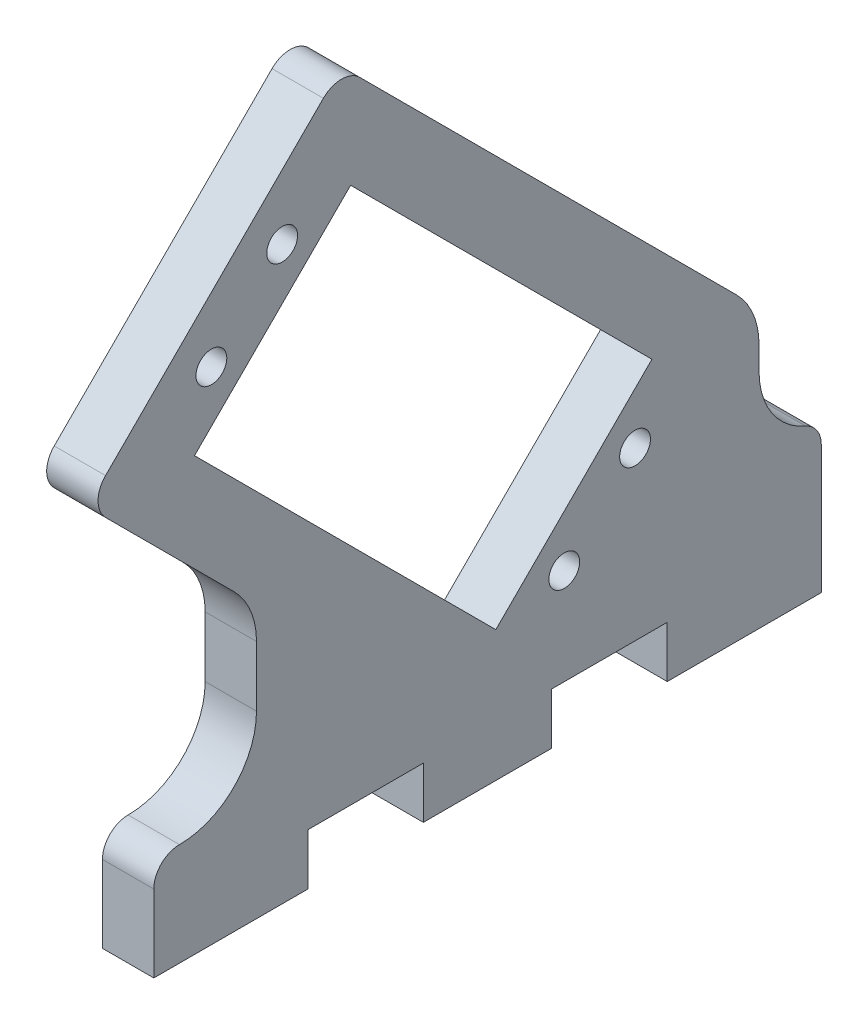
ISO-10303-21;
HEADER;
FILE_DESCRIPTION(('STEP AP214'),'2;1');
FILE_NAME('part.step','',(''),(''),'','','');
FILE_SCHEMA(('AUTOMOTIVE_DESIGN { 1 0 10303 214 1 1 1 1 }'));
ENDSEC;
DATA;
#1=APPLICATION_CONTEXT('core data for automotive mechanical design processes');
#2=APPLICATION_PROTOCOL_DEFINITION('international standard','automotive_design',2000,#1);
#3=PRODUCT_CONTEXT('',#1,'mechanical');
#4=PRODUCT('Part','Part','',(#3));
#5=PRODUCT_RELATED_PRODUCT_CATEGORY('part','',(#4));
#6=PRODUCT_DEFINITION_FORMATION('','',#4);
#7=PRODUCT_DEFINITION_CONTEXT('part definition',#1,'design');
#8=PRODUCT_DEFINITION('design','',#6,#7);
#9=PRODUCT_DEFINITION_SHAPE('','',#8);
#10=(LENGTH_UNIT() NAMED_UNIT(*) SI_UNIT(.MILLI.,.METRE.));
#11=(NAMED_UNIT(*) PLANE_ANGLE_UNIT() SI_UNIT($,.RADIAN.));
#12=(NAMED_UNIT(*) SI_UNIT($,.STERADIAN.) SOLID_ANGLE_UNIT());
#13=UNCERTAINTY_MEASURE_WITH_UNIT(LENGTH_MEASURE(1.E-05),#10,'distance_accuracy_value','');
#14=(GEOMETRIC_REPRESENTATION_CONTEXT(3) GLOBAL_UNCERTAINTY_ASSIGNED_CONTEXT((#13)) GLOBAL_UNIT_ASSIGNED_CONTEXT((#10,
#11,#12)) REPRESENTATION_CONTEXT('',''));
#15=CARTESIAN_POINT('',(0.,0.,0.));
#16=DIRECTION('',(0.,0.,1.));
#17=DIRECTION('',(1.,0.,0.));
#18=AXIS2_PLACEMENT_3D('',#15,#16,#17);
#19=CARTESIAN_POINT('',(0.,0.,0.));
#20=DIRECTION('',(1.,0.,0.));
#21=DIRECTION('',(0.,0.,-1.));
#22=AXIS2_PLACEMENT_3D('',#19,#20,#21);
#23=PLANE('',#22);
#24=CARTESIAN_POINT('',(0.,21.2644507754515,-46.866522151183));
#25=DIRECTION('',(-1.,0.,0.));
#26=DIRECTION('',(0.,0.,1.));
#27=AXIS2_PLACEMENT_3D('',#24,#25,#26);
#28=CIRCLE('',#27,1.5);
#29=CARTESIAN_POINT('',(0.,21.2644507754515,-45.366522151183));
#30=VERTEX_POINT('',#29);
#31=EDGE_CURVE('E243',#30,#30,#28,.F.);
#32=ORIENTED_EDGE('',*,*,#31,.T.);
#33=EDGE_LOOP('',(#32));
#34=FACE_BOUND('',#33,.T.);
#35=CARTESIAN_POINT('',(0.,48.7355492245485,-5.60684146894777));
#36=DIRECTION('',(-1.,0.,0.));
#37=DIRECTION('',(0.,0.,1.));
#38=AXIS2_PLACEMENT_3D('',#35,#36,#37);
#39=CIRCLE('',#38,1.50000000000024);
#40=CARTESIAN_POINT('',(0.,48.7355492245485,-4.10684146894753));
#41=VERTEX_POINT('',#40);
#42=EDGE_CURVE('E485',#41,#41,#39,.F.);
#43=ORIENTED_EDGE('',*,*,#42,.T.);
#44=EDGE_LOOP('',(#43));
#45=FACE_BOUND('',#44,.T.);
#46=CARTESIAN_POINT('',(0.,55.6298403411174,-12.5011325855165));
#47=DIRECTION('',(-1.,0.,0.));
#48=DIRECTION('',(0.,0.,1.));
#49=AXIS2_PLACEMENT_3D('',#46,#47,#48);
#50=CIRCLE('',#49,1.49999999999996);
#51=CARTESIAN_POINT('',(0.,55.6298403411174,-11.0011325855166));
#52=VERTEX_POINT('',#51);
#53=EDGE_CURVE('E248',#52,#52,#50,.F.);
#54=ORIENTED_EDGE('',*,*,#53,.T.);
#55=EDGE_LOOP('',(#54));
#56=FACE_BOUND('',#55,.T.);
#57=CARTESIAN_POINT('',(0.,23.9384469938531,-51.4403704399434));
#58=DIRECTION('',(-1.,0.,0.));
#59=DIRECTION('',(0.,0.,1.));
#60=AXIS2_PLACEMENT_3D('',#57,#58,#59);
#61=CIRCLE('',#60,7.5);
#62=CARTESIAN_POINT('',(0.,23.938446993853,-58.9403704399434));
#63=VERTEX_POINT('',#62);
#64=CARTESIAN_POINT('',(0.,29.2417478527523,-56.7436712988425));
#65=VERTEX_POINT('',#64);
#66=EDGE_CURVE('E390',#63,#65,#61,.F.);
#67=ORIENTED_EDGE('',*,*,#66,.F.);
#68=DIRECTION('',(0.,-1.,0.));
#69=VECTOR('',#68,1.);
#70=CARTESIAN_POINT('',(0.,15.,-58.9403704399433));
#71=LINE('',#70,#69);
#72=CARTESIAN_POINT('',(0.,21.6909455876978,-58.9403704399434));
#73=VERTEX_POINT('',#72);
#74=EDGE_CURVE('E119',#63,#73,#71,.T.);
#75=ORIENTED_EDGE('',*,*,#74,.T.);
#76=CARTESIAN_POINT('',(0.,21.6909455876977,-66.4403704399434));
#77=DIRECTION('',(-1.,0.,0.));
#78=DIRECTION('',(0.,0.,1.));
#79=AXIS2_PLACEMENT_3D('',#76,#77,#78);
#80=CIRCLE('',#79,7.5);
#81=CARTESIAN_POINT('',(0.,14.7977363969244,-63.4850926099858));
#82=VERTEX_POINT('',#81);
#83=EDGE_CURVE('E249',#73,#82,#80,.F.);
#84=ORIENTED_EDGE('',*,*,#83,.T.);
#85=CARTESIAN_POINT('',(0.,12.5,-62.5));
#86=DIRECTION('',(-1.,0.,0.));
#87=DIRECTION('',(0.,0.,1.));
#88=AXIS2_PLACEMENT_3D('',#85,#86,#87);
#89=CIRCLE('',#88,2.5);
#90=CARTESIAN_POINT('',(0.,12.5,-65.));
#91=VERTEX_POINT('',#90);
#92=EDGE_CURVE('E255',#91,#82,#89,.F.);
#93=ORIENTED_EDGE('',*,*,#92,.F.);
#94=DIRECTION('',(0.,-1.,0.));
#95=VECTOR('',#94,1.);
#96=CARTESIAN_POINT('',(0.,0.,-65.));
#97=LINE('',#96,#95);
#98=CARTESIAN_POINT('',(0.,0.,-65.));
#99=VERTEX_POINT('',#98);
#100=EDGE_CURVE('E258',#91,#99,#97,.T.);
#101=ORIENTED_EDGE('',*,*,#100,.T.);
#102=DIRECTION('',(0.,0.,1.));
#103=VECTOR('',#102,1.);
#104=CARTESIAN_POINT('',(0.,0.,-50.));
#105=LINE('',#104,#103);
#106=CARTESIAN_POINT('',(0.,0.,-50.));
#107=VERTEX_POINT('',#106);
#108=EDGE_CURVE('E259',#99,#107,#105,.T.);
#109=ORIENTED_EDGE('',*,*,#108,.T.);
#110=DIRECTION('',(0.,1.,0.));
#111=VECTOR('',#110,1.);
#112=CARTESIAN_POINT('',(0.,5.,-50.));
#113=LINE('',#112,#111);
#114=CARTESIAN_POINT('',(0.,5.,-50.));
#115=VERTEX_POINT('',#114);
#116=EDGE_CURVE('E271',#107,#115,#113,.T.);
#117=ORIENTED_EDGE('',*,*,#116,.T.);
#118=DIRECTION('',(0.,0.,1.));
#119=VECTOR('',#118,1.);
#120=CARTESIAN_POINT('',(0.,5.,-38.75));
#121=LINE('',#120,#119);
#122=CARTESIAN_POINT('',(0.,5.,-38.75));
#123=VERTEX_POINT('',#122);
#124=EDGE_CURVE('E281',#115,#123,#121,.T.);
#125=ORIENTED_EDGE('',*,*,#124,.T.);
#126=DIRECTION('',(0.,1.,0.));
#127=VECTOR('',#126,1.);
#128=CARTESIAN_POINT('',(0.,0.,-38.75));
#129=LINE('',#128,#127);
#130=CARTESIAN_POINT('',(0.,0.,-38.75));
#131=VERTEX_POINT('',#130);
#132=EDGE_CURVE('E291',#123,#131,#129,.F.);
#133=ORIENTED_EDGE('',*,*,#132,.T.);
#134=DIRECTION('',(0.,0.,1.));
#135=VECTOR('',#134,1.);
#136=CARTESIAN_POINT('',(0.,0.,-26.25));
#137=LINE('',#136,#135);
#138=CARTESIAN_POINT('',(0.,0.,-26.25));
#139=VERTEX_POINT('',#138);
#140=EDGE_CURVE('E301',#131,#139,#137,.T.);
#141=ORIENTED_EDGE('',*,*,#140,.T.);
#142=DIRECTION('',(0.,1.,0.));
#143=VECTOR('',#142,1.);
#144=CARTESIAN_POINT('',(0.,5.,-26.25));
#145=LINE('',#144,#143);
#146=CARTESIAN_POINT('',(0.,5.,-26.25));
#147=VERTEX_POINT('',#146);
#148=EDGE_CURVE('E311',#139,#147,#145,.T.);
#149=ORIENTED_EDGE('',*,*,#148,.T.);
#150=DIRECTION('',(0.,0.,1.));
#151=VECTOR('',#150,1.);
#152=CARTESIAN_POINT('',(0.,5.,-15.));
#153=LINE('',#152,#151);
#154=CARTESIAN_POINT('',(0.,5.,-15.));
#155=VERTEX_POINT('',#154);
#156=EDGE_CURVE('E321',#147,#155,#153,.T.);
#157=ORIENTED_EDGE('',*,*,#156,.T.);
#158=DIRECTION('',(0.,1.,0.));
#159=VECTOR('',#158,1.);
#160=CARTESIAN_POINT('',(0.,0.,-15.));
#161=LINE('',#160,#159);
#162=CARTESIAN_POINT('',(0.,0.,-15.));
#163=VERTEX_POINT('',#162);
#164=EDGE_CURVE('E331',#155,#163,#161,.F.);
#165=ORIENTED_EDGE('',*,*,#164,.T.);
#166=DIRECTION('',(0.,0.,1.));
#167=VECTOR('',#166,1.);
#168=CARTESIAN_POINT('',(0.,0.,0.));
#169=LINE('',#168,#167);
#170=CARTESIAN_POINT('',(0.,0.,0.));
#171=VERTEX_POINT('',#170);
#172=EDGE_CURVE('E341',#163,#171,#169,.T.);
#173=ORIENTED_EDGE('',*,*,#172,.T.);
#174=DIRECTION('',(0.,1.,0.));
#175=VECTOR('',#174,1.);
#176=CARTESIAN_POINT('',(0.,10.,0.));
#177=LINE('',#176,#175);
#178=CARTESIAN_POINT('',(0.,7.5,0.));
#179=VERTEX_POINT('',#178);
#180=EDGE_CURVE('E355',#171,#179,#177,.T.);
#181=ORIENTED_EDGE('',*,*,#180,.T.);
#182=CARTESIAN_POINT('',(0.,7.5,-2.5));
#183=DIRECTION('',(-1.,0.,0.));
#184=DIRECTION('',(0.,0.,1.));
#185=AXIS2_PLACEMENT_3D('',#182,#183,#184);
#186=CIRCLE('',#185,2.5);
#187=CARTESIAN_POINT('',(0.,10.,-2.5));
#188=VERTEX_POINT('',#187);
#189=EDGE_CURVE('E359',#188,#179,#186,.F.);
#190=ORIENTED_EDGE('',*,*,#189,.F.);
#191=CARTESIAN_POINT('',(0.,17.5,-2.5));
#192=DIRECTION('',(1.,0.,0.));
#193=DIRECTION('',(0.,0.,-1.));
#194=AXIS2_PLACEMENT_3D('',#191,#192,#193);
#195=CIRCLE('',#194,7.5);
#196=CARTESIAN_POINT('',(0.,17.5,-10.));
#197=VERTEX_POINT('',#196);
#198=EDGE_CURVE('E362',#188,#197,#195,.T.);
#199=ORIENTED_EDGE('',*,*,#198,.T.);
#200=DIRECTION('',(0.,1.,0.));
#201=VECTOR('',#200,1.);
#202=CARTESIAN_POINT('',(0.,26.4879444685361,-10.));
#203=LINE('',#202,#201);
#204=CARTESIAN_POINT('',(0.,23.3813427507378,-10.));
#205=VERTEX_POINT('',#204);
#206=EDGE_CURVE('E365',#197,#205,#203,.T.);
#207=ORIENTED_EDGE('',*,*,#206,.T.);
#208=CARTESIAN_POINT('',(0.,23.3813427507378,-2.5));
#209=DIRECTION('',(1.,0.,0.));
#210=DIRECTION('',(0.,0.,-1.));
#211=AXIS2_PLACEMENT_3D('',#208,#209,#210);
#212=CIRCLE('',#211,7.5);
#213=CARTESIAN_POINT('',(0.,28.684643609637,-7.80330085889907));
#214=VERTEX_POINT('',#213);
#215=EDGE_CURVE('E368',#205,#214,#212,.T.);
#216=ORIENTED_EDGE('',*,*,#215,.T.);
#217=DIRECTION('',(0.,0.707106781186542,0.707106781186553));
#218=VECTOR('',#217,1.);
#219=CARTESIAN_POINT('',(0.,42.9549512883482,6.46700681981233));
#220=LINE('',#219,#218);
#221=CARTESIAN_POINT('',(0.,41.1871843353818,4.69923986684595));
#222=VERTEX_POINT('',#221);
#223=EDGE_CURVE('E372',#214,#222,#220,.T.);
#224=ORIENTED_EDGE('',*,*,#223,.T.);
#225=CARTESIAN_POINT('',(0.,42.9549512883482,2.9314729138796));
#226=DIRECTION('',(-1.,0.,0.));
#227=DIRECTION('',(0.,0.,1.));
#228=AXIS2_PLACEMENT_3D('',#225,#226,#227);
#229=CIRCLE('',#228,2.5);
#230=CARTESIAN_POINT('',(0.,44.7227182413145,4.69923986684598));
#231=VERTEX_POINT('',#230);
#232=EDGE_CURVE('E373',#231,#222,#229,.F.);
#233=ORIENTED_EDGE('',*,*,#232,.F.);
#234=DIRECTION('',(0.,0.707106781186553,-0.707106781186542));
#235=VECTOR('',#234,1.);
#236=CARTESIAN_POINT('',(0.,42.9549512883482,6.46700681981233));
#237=LINE('',#236,#235);
#238=CARTESIAN_POINT('',(0.,65.9359216769111,-16.5139635687503));
#239=VERTEX_POINT('',#238);
#240=EDGE_CURVE('E379',#231,#239,#237,.T.);
#241=ORIENTED_EDGE('',*,*,#240,.T.);
#242=CARTESIAN_POINT('',(0.,64.1681547239448,-18.2817305217167));
#243=DIRECTION('',(-1.,0.,0.));
#244=DIRECTION('',(0.,0.,1.));
#245=AXIS2_PLACEMENT_3D('',#242,#243,#244);
#246=CIRCLE('',#245,2.5);
#247=CARTESIAN_POINT('',(0.,65.9359216769112,-20.049497474683));
#248=VERTEX_POINT('',#247);
#249=EDGE_CURVE('E383',#248,#239,#246,.F.);
#250=ORIENTED_EDGE('',*,*,#249,.F.);
#251=DIRECTION('',(0.,-0.707106781186542,-0.707106781186553));
#252=VECTOR('',#251,1.);
#253=CARTESIAN_POINT('',(0.,67.7036886298775,-18.2817305217166));
#254=LINE('',#253,#252);
#255=EDGE_CURVE('E386',#248,#65,#254,.T.);
#256=ORIENTED_EDGE('',*,*,#255,.T.);
#257=EDGE_LOOP('',(#67,#75,#84,#93,#101,#109,#117,#125,#133,#141,#149,#157,#165,#173,#181,#190,
#199,#207,#216,#224,#233,#241,#250,#256));
#258=FACE_BOUND('',#257,.T.);
#259=DIRECTION('',(0.,0.707106781186542,0.707106781186553));
#260=VECTOR('',#259,1.);
#261=CARTESIAN_POINT('',(0.,42.0710678118647,-3.96281820269097));
#262=LINE('',#261,#260);
#263=CARTESIAN_POINT('',(0.,12.7261363926231,-33.3077496219329));
#264=VERTEX_POINT('',#263);
#265=CARTESIAN_POINT('',(0.,42.0710678118647,-3.96281820269097));
#266=VERTEX_POINT('',#265);
#267=EDGE_CURVE('E129',#264,#266,#262,.T.);
#268=ORIENTED_EDGE('',*,*,#267,.F.);
#269=DIRECTION('',(0.,-0.707106781186553,0.707106781186542));
#270=VECTOR('',#269,1.);
#271=CARTESIAN_POINT('',(0.,12.7261363926231,-33.3077496219329));
#272=LINE('',#271,#270);
#273=CARTESIAN_POINT('',(0.,27.928932188134,-48.5105454174436));
#274=VERTEX_POINT('',#273);
#275=EDGE_CURVE('E394',#274,#264,#272,.T.);
#276=ORIENTED_EDGE('',*,*,#275,.F.);
#277=DIRECTION('',(0.,-0.707106781186542,-0.707106781186553));
#278=VECTOR('',#277,1.);
#279=CARTESIAN_POINT('',(0.,57.2738636073755,-19.1656139982016));
#280=LINE('',#279,#278);
#281=CARTESIAN_POINT('',(0.,57.2738636073755,-19.1656139982016));
#282=VERTEX_POINT('',#281);
#283=EDGE_CURVE('E224',#282,#274,#280,.T.);
#284=ORIENTED_EDGE('',*,*,#283,.F.);
#285=DIRECTION('',(0.,0.707106781186553,-0.707106781186542));
#286=VECTOR('',#285,1.);
#287=CARTESIAN_POINT('',(0.,42.0710678118647,-3.96281820269097));
#288=LINE('',#287,#286);
#289=EDGE_CURVE('E225',#266,#282,#288,.T.);
#290=ORIENTED_EDGE('',*,*,#289,.F.);
#291=EDGE_LOOP('',(#268,#276,#284,#290));
#292=FACE_BOUND('',#291,.T.);
#293=CARTESIAN_POINT('',(0.,14.3701596588826,-39.9722310346143));
#294=DIRECTION('',(-1.,0.,0.));
#295=DIRECTION('',(0.,0.,1.));
#296=AXIS2_PLACEMENT_3D('',#293,#294,#295);
#297=CIRCLE('',#296,1.50000000000002);
#298=CARTESIAN_POINT('',(0.,14.3701596588826,-38.4722310346142));
#299=VERTEX_POINT('',#298);
#300=EDGE_CURVE('E19',#299,#299,#297,.F.);
#301=ORIENTED_EDGE('',*,*,#300,.T.);
#302=EDGE_LOOP('',(#301));
#303=FACE_BOUND('',#302,.T.);
#304=ADVANCED_FACE('F16',(#34,#45,#56,#258,#292,#303),#23,.F.);
#305=CARTESIAN_POINT('',(5.,14.3701596588826,-39.9722310346143));
#306=DIRECTION('',(-1.,0.,0.));
#307=DIRECTION('',(0.,0.,1.));
#308=AXIS2_PLACEMENT_3D('',#305,#306,#307);
#309=CYLINDRICAL_SURFACE('',#308,1.50000000000002);
#310=CARTESIAN_POINT('',(5.,14.3701596588826,-39.9722310346143));
#311=DIRECTION('',(-1.,0.,0.));
#312=DIRECTION('',(0.,0.,1.));
#313=AXIS2_PLACEMENT_3D('',#310,#311,#312);
#314=CIRCLE('',#313,1.50000000000002);
#315=CARTESIAN_POINT('',(5.,14.3701596588826,-38.4722310346142));
#316=VERTEX_POINT('',#315);
#317=EDGE_CURVE('E240',#316,#316,#314,.T.);
#318=ORIENTED_EDGE('',*,*,#317,.F.);
#319=EDGE_LOOP('',(#318));
#320=FACE_BOUND('',#319,.T.);
#321=ORIENTED_EDGE('',*,*,#300,.F.);
#322=EDGE_LOOP('',(#321));
#323=FACE_BOUND('',#322,.T.);
#324=ADVANCED_FACE('F520',(#320,#323),#309,.F.);
#325=CARTESIAN_POINT('',(5.,42.0710678118647,-3.96281820269097));
#326=DIRECTION('',(0.,0.707106781186553,-0.707106781186542));
#327=DIRECTION('',(0.,0.707106781186542,0.707106781186553));
#328=AXIS2_PLACEMENT_3D('',#325,#326,#327);
#329=PLANE('',#328);
#330=DIRECTION('',(0.,0.707106781186542,0.707106781186553));
#331=VECTOR('',#330,1.);
#332=CARTESIAN_POINT('',(5.,12.7261363926231,-33.3077496219329));
#333=LINE('',#332,#331);
#334=CARTESIAN_POINT('',(5.,12.7261363926231,-33.3077496219329));
#335=VERTEX_POINT('',#334);
#336=CARTESIAN_POINT('',(5.,42.0710678118647,-3.96281820269097));
#337=VERTEX_POINT('',#336);
#338=EDGE_CURVE('E220',#335,#337,#333,.T.);
#339=ORIENTED_EDGE('',*,*,#338,.F.);
#340=DIRECTION('',(1.,0.,0.));
#341=VECTOR('',#340,1.);
#342=CARTESIAN_POINT('',(5.,12.7261363926231,-33.3077496219329));
#343=LINE('',#342,#341);
#344=EDGE_CURVE('E392',#264,#335,#343,.T.);
#345=ORIENTED_EDGE('',*,*,#344,.F.);
#346=ORIENTED_EDGE('',*,*,#267,.T.);
#347=DIRECTION('',(1.,0.,0.));
#348=VECTOR('',#347,1.);
#349=CARTESIAN_POINT('',(5.,42.0710678118647,-3.96281820269097));
#350=LINE('',#349,#348);
#351=EDGE_CURVE('E216',#337,#266,#350,.F.);
#352=ORIENTED_EDGE('',*,*,#351,.F.);
#353=EDGE_LOOP('',(#339,#345,#346,#352));
#354=FACE_BOUND('',#353,.T.);
#355=ADVANCED_FACE('F218',(#354),#329,.T.);
#356=CARTESIAN_POINT('',(5.,42.0710678118647,-3.96281820269097));
#357=DIRECTION('',(0.,-0.707106781186542,-0.707106781186553));
#358=DIRECTION('',(0.,0.707106781186553,-0.707106781186542));
#359=AXIS2_PLACEMENT_3D('',#356,#357,#358);
#360=PLANE('',#359);
#361=DIRECTION('',(0.,0.707106781186552,-0.707106781186542));
#362=VECTOR('',#361,1.);
#363=CARTESIAN_POINT('',(5.,42.0710678118647,-3.96281820269097));
#364=LINE('',#363,#362);
#365=CARTESIAN_POINT('',(5.,57.2738636073755,-19.1656139982016));
#366=VERTEX_POINT('',#365);
#367=EDGE_CURVE('E228',#337,#366,#364,.T.);
#368=ORIENTED_EDGE('',*,*,#367,.F.);
#369=ORIENTED_EDGE('',*,*,#351,.T.);
#370=ORIENTED_EDGE('',*,*,#289,.T.);
#371=DIRECTION('',(1.,0.,0.));
#372=VECTOR('',#371,1.);
#373=CARTESIAN_POINT('',(5.,57.2738636073755,-19.1656139982016));
#374=LINE('',#373,#372);
#375=EDGE_CURVE('E231',#366,#282,#374,.F.);
#376=ORIENTED_EDGE('',*,*,#375,.F.);
#377=EDGE_LOOP('',(#368,#369,#370,#376));
#378=FACE_BOUND('',#377,.T.);
#379=ADVANCED_FACE('F229',(#378),#360,.T.);
#380=CARTESIAN_POINT('',(5.,57.2738636073755,-19.1656139982016));
#381=DIRECTION('',(0.,-0.707106781186553,0.707106781186542));
#382=DIRECTION('',(0.,-0.707106781186542,-0.707106781186553));
#383=AXIS2_PLACEMENT_3D('',#380,#381,#382);
#384=PLANE('',#383);
#385=DIRECTION('',(0.,-0.707106781186542,-0.707106781186552));
#386=VECTOR('',#385,1.);
#387=CARTESIAN_POINT('',(5.,57.2738636073755,-19.1656139982016));
#388=LINE('',#387,#386);
#389=CARTESIAN_POINT('',(5.,27.928932188134,-48.5105454174436));
#390=VERTEX_POINT('',#389);
#391=EDGE_CURVE('E234',#366,#390,#388,.T.);
#392=ORIENTED_EDGE('',*,*,#391,.F.);
#393=ORIENTED_EDGE('',*,*,#375,.T.);
#394=ORIENTED_EDGE('',*,*,#283,.T.);
#395=DIRECTION('',(1.,0.,0.));
#396=VECTOR('',#395,1.);
#397=CARTESIAN_POINT('',(5.,27.928932188134,-48.5105454174436));
#398=LINE('',#397,#396);
#399=EDGE_CURVE('E206',#390,#274,#398,.F.);
#400=ORIENTED_EDGE('',*,*,#399,.F.);
#401=EDGE_LOOP('',(#392,#393,#394,#400));
#402=FACE_BOUND('',#401,.T.);
#403=ADVANCED_FACE('F515',(#402),#384,.T.);
#404=CARTESIAN_POINT('',(5.,12.7261363926231,-33.3077496219329));
#405=DIRECTION('',(0.,0.707106781186542,0.707106781186553));
#406=DIRECTION('',(0.,-0.707106781186553,0.707106781186542));
#407=AXIS2_PLACEMENT_3D('',#404,#405,#406);
#408=PLANE('',#407);
#409=DIRECTION('',(0.,-0.707106781186553,0.707106781186542));
#410=VECTOR('',#409,1.);
#411=CARTESIAN_POINT('',(5.,27.928932188134,-48.5105454174436));
#412=LINE('',#411,#410);
#413=EDGE_CURVE('E239',#390,#335,#412,.T.);
#414=ORIENTED_EDGE('',*,*,#413,.F.);
#415=ORIENTED_EDGE('',*,*,#399,.T.);
#416=ORIENTED_EDGE('',*,*,#275,.T.);
#417=ORIENTED_EDGE('',*,*,#344,.T.);
#418=EDGE_LOOP('',(#414,#415,#416,#417));
#419=FACE_BOUND('',#418,.T.);
#420=ADVANCED_FACE('F517',(#419),#408,.T.);
#421=CARTESIAN_POINT('',(5.,15.,-58.9403704399433));
#422=DIRECTION('',(0.,0.,1.));
#423=DIRECTION('',(0.,-1.,0.));
#424=AXIS2_PLACEMENT_3D('',#421,#422,#423);
#425=PLANE('',#424);
#426=DIRECTION('',(-1.,0.,0.));
#427=VECTOR('',#426,1.);
#428=CARTESIAN_POINT('',(5.,23.938446993853,-58.9403704399434));
#429=LINE('',#428,#427);
#430=CARTESIAN_POINT('',(5.,23.9384469938531,-58.9403704399434));
#431=VERTEX_POINT('',#430);
#432=EDGE_CURVE('E387',#431,#63,#429,.T.);
#433=ORIENTED_EDGE('',*,*,#432,.F.);
#434=DIRECTION('',(0.,1.,0.));
#435=VECTOR('',#434,1.);
#436=CARTESIAN_POINT('',(5.,0.,-58.9403704399433));
#437=LINE('',#436,#435);
#438=CARTESIAN_POINT('',(5.,21.6909455876977,-58.9403704399434));
#439=VERTEX_POINT('',#438);
#440=EDGE_CURVE('E197',#439,#431,#437,.T.);
#441=ORIENTED_EDGE('',*,*,#440,.F.);
#442=DIRECTION('',(-1.,0.,0.));
#443=VECTOR('',#442,1.);
#444=CARTESIAN_POINT('',(5.,21.6909455876977,-58.9403704399434));
#445=LINE('',#444,#443);
#446=EDGE_CURVE('E250',#439,#73,#445,.T.);
#447=ORIENTED_EDGE('',*,*,#446,.T.);
#448=ORIENTED_EDGE('',*,*,#74,.F.);
#449=EDGE_LOOP('',(#433,#441,#447,#448));
#450=FACE_BOUND('',#449,.T.);
#451=ADVANCED_FACE('F639',(#450),#425,.F.);
#452=CARTESIAN_POINT('',(5.,23.9384469938531,-51.4403704399434));
#453=DIRECTION('',(-1.,0.,0.));
#454=DIRECTION('',(0.,0.,1.));
#455=AXIS2_PLACEMENT_3D('',#452,#453,#454);
#456=CYLINDRICAL_SURFACE('',#455,7.5);
#457=ORIENTED_EDGE('',*,*,#66,.T.);
#458=DIRECTION('',(1.,0.,0.));
#459=VECTOR('',#458,1.);
#460=CARTESIAN_POINT('',(5.,29.2417478527522,-56.7436712988425));
#461=LINE('',#460,#459);
#462=CARTESIAN_POINT('',(5.,29.2417478527523,-56.7436712988425));
#463=VERTEX_POINT('',#462);
#464=EDGE_CURVE('E384',#65,#463,#461,.T.);
#465=ORIENTED_EDGE('',*,*,#464,.T.);
#466=CARTESIAN_POINT('',(5.,23.9384469938531,-51.4403704399434));
#467=DIRECTION('',(-1.,0.,0.));
#468=DIRECTION('',(0.,0.,1.));
#469=AXIS2_PLACEMENT_3D('',#466,#467,#468);
#470=CIRCLE('',#469,7.5);
#471=EDGE_CURVE('E480',#431,#463,#470,.F.);
#472=ORIENTED_EDGE('',*,*,#471,.F.);
#473=ORIENTED_EDGE('',*,*,#432,.T.);
#474=EDGE_LOOP('',(#457,#465,#472,#473));
#475=FACE_BOUND('',#474,.T.);
#476=ADVANCED_FACE('F501',(#475),#456,.T.);
#477=CARTESIAN_POINT('',(5.,67.7036886298775,-18.2817305217166));
#478=DIRECTION('',(0.,-0.707106781186553,0.707106781186542));
#479=DIRECTION('',(0.,-0.707106781186542,-0.707106781186553));
#480=AXIS2_PLACEMENT_3D('',#477,#478,#479);
#481=PLANE('',#480);
#482=ORIENTED_EDGE('',*,*,#464,.F.);
#483=ORIENTED_EDGE('',*,*,#255,.F.);
#484=DIRECTION('',(-1.,0.,0.));
#485=VECTOR('',#484,1.);
#486=CARTESIAN_POINT('',(5.,65.9359216769112,-20.049497474683));
#487=LINE('',#486,#485);
#488=CARTESIAN_POINT('',(5.,65.9359216769112,-20.049497474683));
#489=VERTEX_POINT('',#488);
#490=EDGE_CURVE('E380',#489,#248,#487,.T.);
#491=ORIENTED_EDGE('',*,*,#490,.F.);
#492=DIRECTION('',(0.,0.707106781186542,0.707106781186553));
#493=VECTOR('',#492,1.);
#494=CARTESIAN_POINT('',(5.,29.2417478527523,-56.7436712988425));
#495=LINE('',#494,#493);
#496=EDGE_CURVE('E479',#463,#489,#495,.T.);
#497=ORIENTED_EDGE('',*,*,#496,.F.);
#498=EDGE_LOOP('',(#482,#483,#491,#497));
#499=FACE_BOUND('',#498,.T.);
#500=ADVANCED_FACE('F506',(#499),#481,.F.);
#501=CARTESIAN_POINT('',(5.,64.1681547239448,-18.2817305217167));
#502=DIRECTION('',(-1.,0.,0.));
#503=DIRECTION('',(0.,0.,1.));
#504=AXIS2_PLACEMENT_3D('',#501,#502,#503);
#505=CYLINDRICAL_SURFACE('',#504,2.5);
#506=ORIENTED_EDGE('',*,*,#249,.T.);
#507=DIRECTION('',(1.,0.,0.));
#508=VECTOR('',#507,1.);
#509=CARTESIAN_POINT('',(5.,65.9359216769111,-16.5139635687503));
#510=LINE('',#509,#508);
#511=CARTESIAN_POINT('',(5.,65.9359216769111,-16.5139635687503));
#512=VERTEX_POINT('',#511);
#513=EDGE_CURVE('E377',#239,#512,#510,.T.);
#514=ORIENTED_EDGE('',*,*,#513,.T.);
#515=CARTESIAN_POINT('',(5.,64.1681547239448,-18.2817305217167));
#516=DIRECTION('',(-1.,0.,0.));
#517=DIRECTION('',(0.,0.,1.));
#518=AXIS2_PLACEMENT_3D('',#515,#516,#517);
#519=CIRCLE('',#518,2.5);
#520=EDGE_CURVE('E476',#489,#512,#519,.F.);
#521=ORIENTED_EDGE('',*,*,#520,.F.);
#522=ORIENTED_EDGE('',*,*,#490,.T.);
#523=EDGE_LOOP('',(#506,#514,#521,#522));
#524=FACE_BOUND('',#523,.T.);
#525=ADVANCED_FACE('F630',(#524),#505,.T.);
#526=CARTESIAN_POINT('',(5.,42.9549512883482,6.46700681981233));
#527=DIRECTION('',(0.,-0.707106781186542,-0.707106781186553));
#528=DIRECTION('',(0.,0.707106781186553,-0.707106781186542));
#529=AXIS2_PLACEMENT_3D('',#526,#527,#528);
#530=PLANE('',#529);
#531=ORIENTED_EDGE('',*,*,#513,.F.);
#532=ORIENTED_EDGE('',*,*,#240,.F.);
#533=DIRECTION('',(-1.,0.,0.));
#534=VECTOR('',#533,1.);
#535=CARTESIAN_POINT('',(5.,44.7227182413145,4.69923986684598));
#536=LINE('',#535,#534);
#537=CARTESIAN_POINT('',(5.,44.7227182413145,4.69923986684598));
#538=VERTEX_POINT('',#537);
#539=EDGE_CURVE('E374',#538,#231,#536,.T.);
#540=ORIENTED_EDGE('',*,*,#539,.F.);
#541=DIRECTION('',(0.,-0.707106781186553,0.707106781186542));
#542=VECTOR('',#541,1.);
#543=CARTESIAN_POINT('',(5.,65.9359216769111,-16.5139635687503));
#544=LINE('',#543,#542);
#545=EDGE_CURVE('E475',#512,#538,#544,.T.);
#546=ORIENTED_EDGE('',*,*,#545,.F.);
#547=EDGE_LOOP('',(#531,#532,#540,#546));
#548=FACE_BOUND('',#547,.T.);
#549=ADVANCED_FACE('F626',(#548),#530,.F.);
#550=CARTESIAN_POINT('',(5.,42.9549512883482,2.9314729138796));
#551=DIRECTION('',(-1.,0.,0.));
#552=DIRECTION('',(0.,0.,1.));
#553=AXIS2_PLACEMENT_3D('',#550,#551,#552);
#554=CYLINDRICAL_SURFACE('',#553,2.5);
#555=ORIENTED_EDGE('',*,*,#232,.T.);
#556=DIRECTION('',(1.,0.,0.));
#557=VECTOR('',#556,1.);
#558=CARTESIAN_POINT('',(5.,41.1871843353818,4.69923986684595));
#559=LINE('',#558,#557);
#560=CARTESIAN_POINT('',(5.,41.1871843353818,4.69923986684595));
#561=VERTEX_POINT('',#560);
#562=EDGE_CURVE('E369',#222,#561,#559,.T.);
#563=ORIENTED_EDGE('',*,*,#562,.T.);
#564=CARTESIAN_POINT('',(5.,42.9549512883482,2.9314729138796));
#565=DIRECTION('',(-1.,0.,0.));
#566=DIRECTION('',(0.,0.,1.));
#567=AXIS2_PLACEMENT_3D('',#564,#565,#566);
#568=CIRCLE('',#567,2.5);
#569=EDGE_CURVE('E473',#538,#561,#568,.F.);
#570=ORIENTED_EDGE('',*,*,#569,.F.);
#571=ORIENTED_EDGE('',*,*,#539,.T.);
#572=EDGE_LOOP('',(#555,#563,#570,#571));
#573=FACE_BOUND('',#572,.T.);
#574=ADVANCED_FACE('F622',(#573),#554,.T.);
#575=CARTESIAN_POINT('',(5.,42.9549512883482,6.46700681981233));
#576=DIRECTION('',(0.,0.707106781186553,-0.707106781186542));
#577=DIRECTION('',(0.,0.707106781186542,0.707106781186553));
#578=AXIS2_PLACEMENT_3D('',#575,#576,#577);
#579=PLANE('',#578);
#580=DIRECTION('',(1.,0.,0.));
#581=VECTOR('',#580,1.);
#582=CARTESIAN_POINT('',(5.,28.684643609637,-7.80330085889907));
#583=LINE('',#582,#581);
#584=CARTESIAN_POINT('',(5.,28.684643609637,-7.80330085889907));
#585=VERTEX_POINT('',#584);
#586=EDGE_CURVE('E366',#214,#585,#583,.T.);
#587=ORIENTED_EDGE('',*,*,#586,.T.);
#588=DIRECTION('',(0.,-0.707106781186542,-0.707106781186553));
#589=VECTOR('',#588,1.);
#590=CARTESIAN_POINT('',(5.,41.1871843353818,4.69923986684595));
#591=LINE('',#590,#589);
#592=EDGE_CURVE('E472',#561,#585,#591,.T.);
#593=ORIENTED_EDGE('',*,*,#592,.F.);
#594=ORIENTED_EDGE('',*,*,#562,.F.);
#595=ORIENTED_EDGE('',*,*,#223,.F.);
#596=EDGE_LOOP('',(#587,#593,#594,#595));
#597=FACE_BOUND('',#596,.T.);
#598=ADVANCED_FACE('F618',(#597),#579,.F.);
#599=CARTESIAN_POINT('',(5.,23.3813427507378,-2.5));
#600=DIRECTION('',(1.,0.,0.));
#601=DIRECTION('',(0.,0.,-1.));
#602=AXIS2_PLACEMENT_3D('',#599,#600,#601);
#603=CYLINDRICAL_SURFACE('',#602,7.5);
#604=ORIENTED_EDGE('',*,*,#586,.F.);
#605=ORIENTED_EDGE('',*,*,#215,.F.);
#606=DIRECTION('',(-1.,0.,0.));
#607=VECTOR('',#606,1.);
#608=CARTESIAN_POINT('',(5.,23.3813427507378,-10.));
#609=LINE('',#608,#607);
#610=CARTESIAN_POINT('',(5.,23.3813427507378,-10.));
#611=VERTEX_POINT('',#610);
#612=EDGE_CURVE('E363',#205,#611,#609,.F.);
#613=ORIENTED_EDGE('',*,*,#612,.T.);
#614=CARTESIAN_POINT('',(5.,23.3813427507378,-2.5));
#615=DIRECTION('',(1.,0.,0.));
#616=DIRECTION('',(0.,0.,-1.));
#617=AXIS2_PLACEMENT_3D('',#614,#615,#616);
#618=CIRCLE('',#617,7.5);
#619=EDGE_CURVE('E469',#585,#611,#618,.F.);
#620=ORIENTED_EDGE('',*,*,#619,.F.);
#621=EDGE_LOOP('',(#604,#605,#613,#620));
#622=FACE_BOUND('',#621,.T.);
#623=ADVANCED_FACE('F614',(#622),#603,.F.);
#624=CARTESIAN_POINT('',(5.,26.4879444685361,-10.));
#625=DIRECTION('',(0.,0.,-1.));
#626=DIRECTION('',(-1.,0.,0.));
#627=AXIS2_PLACEMENT_3D('',#624,#625,#626);
#628=PLANE('',#627);
#629=DIRECTION('',(1.,0.,0.));
#630=VECTOR('',#629,1.);
#631=CARTESIAN_POINT('',(5.,17.5,-10.));
#632=LINE('',#631,#630);
#633=CARTESIAN_POINT('',(5.,17.5,-10.));
#634=VERTEX_POINT('',#633);
#635=EDGE_CURVE('E360',#197,#634,#632,.T.);
#636=ORIENTED_EDGE('',*,*,#635,.T.);
#637=DIRECTION('',(0.,1.,0.));
#638=VECTOR('',#637,1.);
#639=CARTESIAN_POINT('',(5.,0.,-10.));
#640=LINE('',#639,#638);
#641=EDGE_CURVE('E468',#611,#634,#640,.F.);
#642=ORIENTED_EDGE('',*,*,#641,.F.);
#643=ORIENTED_EDGE('',*,*,#612,.F.);
#644=ORIENTED_EDGE('',*,*,#206,.F.);
#645=EDGE_LOOP('',(#636,#642,#643,#644));
#646=FACE_BOUND('',#645,.T.);
#647=ADVANCED_FACE('F610',(#646),#628,.F.);
#648=CARTESIAN_POINT('',(5.,17.5,-2.5));
#649=DIRECTION('',(1.,0.,0.));
#650=DIRECTION('',(0.,0.,-1.));
#651=AXIS2_PLACEMENT_3D('',#648,#649,#650);
#652=CYLINDRICAL_SURFACE('',#651,7.5);
#653=ORIENTED_EDGE('',*,*,#635,.F.);
#654=ORIENTED_EDGE('',*,*,#198,.F.);
#655=DIRECTION('',(-1.,0.,0.));
#656=VECTOR('',#655,1.);
#657=CARTESIAN_POINT('',(5.,10.,-2.5));
#658=LINE('',#657,#656);
#659=CARTESIAN_POINT('',(5.,10.,-2.5));
#660=VERTEX_POINT('',#659);
#661=EDGE_CURVE('E356',#660,#188,#658,.T.);
#662=ORIENTED_EDGE('',*,*,#661,.F.);
#663=CARTESIAN_POINT('',(5.,17.5,-2.5));
#664=DIRECTION('',(1.,0.,0.));
#665=DIRECTION('',(0.,0.,-1.));
#666=AXIS2_PLACEMENT_3D('',#663,#664,#665);
#667=CIRCLE('',#666,7.5);
#668=EDGE_CURVE('E465',#634,#660,#667,.F.);
#669=ORIENTED_EDGE('',*,*,#668,.F.);
#670=EDGE_LOOP('',(#653,#654,#662,#669));
#671=FACE_BOUND('',#670,.T.);
#672=ADVANCED_FACE('F606',(#671),#652,.F.);
#673=CARTESIAN_POINT('',(5.,7.5,-2.5));
#674=DIRECTION('',(-1.,0.,0.));
#675=DIRECTION('',(0.,0.,1.));
#676=AXIS2_PLACEMENT_3D('',#673,#674,#675);
#677=CYLINDRICAL_SURFACE('',#676,2.5);
#678=ORIENTED_EDGE('',*,*,#189,.T.);
#679=DIRECTION('',(-1.,0.,0.));
#680=VECTOR('',#679,1.);
#681=CARTESIAN_POINT('',(5.,7.5,0.));
#682=LINE('',#681,#680);
#683=CARTESIAN_POINT('',(5.,7.5,0.));
#684=VERTEX_POINT('',#683);
#685=EDGE_CURVE('E351',#179,#684,#682,.F.);
#686=ORIENTED_EDGE('',*,*,#685,.T.);
#687=CARTESIAN_POINT('',(5.,7.5,-2.5));
#688=DIRECTION('',(-1.,0.,0.));
#689=DIRECTION('',(0.,0.,1.));
#690=AXIS2_PLACEMENT_3D('',#687,#688,#689);
#691=CIRCLE('',#690,2.5);
#692=EDGE_CURVE('E462',#660,#684,#691,.F.);
#693=ORIENTED_EDGE('',*,*,#692,.F.);
#694=ORIENTED_EDGE('',*,*,#661,.T.);
#695=EDGE_LOOP('',(#678,#686,#693,#694));
#696=FACE_BOUND('',#695,.T.);
#697=ADVANCED_FACE('F602',(#696),#677,.T.);
#698=CARTESIAN_POINT('',(5.,10.,0.));
#699=DIRECTION('',(0.,0.,-1.));
#700=DIRECTION('',(-1.,0.,0.));
#701=AXIS2_PLACEMENT_3D('',#698,#699,#700);
#702=PLANE('',#701);
#703=ORIENTED_EDGE('',*,*,#685,.F.);
#704=ORIENTED_EDGE('',*,*,#180,.F.);
#705=DIRECTION('',(1.,0.,0.));
#706=VECTOR('',#705,1.);
#707=CARTESIAN_POINT('',(5.,0.,0.));
#708=LINE('',#707,#706);
#709=CARTESIAN_POINT('',(5.,0.,0.));
#710=VERTEX_POINT('',#709);
#711=EDGE_CURVE('E349',#171,#710,#708,.T.);
#712=ORIENTED_EDGE('',*,*,#711,.T.);
#713=DIRECTION('',(0.,1.,0.));
#714=VECTOR('',#713,1.);
#715=CARTESIAN_POINT('',(5.,0.,0.));
#716=LINE('',#715,#714);
#717=EDGE_CURVE('E346',#684,#710,#716,.F.);
#718=ORIENTED_EDGE('',*,*,#717,.F.);
#719=EDGE_LOOP('',(#703,#704,#712,#718));
#720=FACE_BOUND('',#719,.T.);
#721=ADVANCED_FACE('F598',(#720),#702,.F.);
#722=CARTESIAN_POINT('',(5.,0.,0.));
#723=DIRECTION('',(0.,1.,0.));
#724=DIRECTION('',(0.,0.,1.));
#725=AXIS2_PLACEMENT_3D('',#722,#723,#724);
#726=PLANE('',#725);
#727=DIRECTION('',(1.,0.,0.));
#728=VECTOR('',#727,1.);
#729=CARTESIAN_POINT('',(5.,0.,-15.));
#730=LINE('',#729,#728);
#731=CARTESIAN_POINT('',(5.,0.,-15.));
#732=VERTEX_POINT('',#731);
#733=EDGE_CURVE('E339',#163,#732,#730,.T.);
#734=ORIENTED_EDGE('',*,*,#733,.T.);
#735=DIRECTION('',(0.,0.,-1.));
#736=VECTOR('',#735,1.);
#737=CARTESIAN_POINT('',(5.,0.,0.));
#738=LINE('',#737,#736);
#739=EDGE_CURVE('E336',#710,#732,#738,.T.);
#740=ORIENTED_EDGE('',*,*,#739,.F.);
#741=ORIENTED_EDGE('',*,*,#711,.F.);
#742=ORIENTED_EDGE('',*,*,#172,.F.);
#743=EDGE_LOOP('',(#734,#740,#741,#742));
#744=FACE_BOUND('',#743,.T.);
#745=ADVANCED_FACE('F594',(#744),#726,.F.);
#746=CARTESIAN_POINT('',(5.,0.,-15.));
#747=DIRECTION('',(0.,0.,1.));
#748=DIRECTION('',(1.,0.,0.));
#749=AXIS2_PLACEMENT_3D('',#746,#747,#748);
#750=PLANE('',#749);
#751=DIRECTION('',(1.,0.,0.));
#752=VECTOR('',#751,1.);
#753=CARTESIAN_POINT('',(5.,5.,-15.));
#754=LINE('',#753,#752);
#755=CARTESIAN_POINT('',(5.,5.,-15.));
#756=VERTEX_POINT('',#755);
#757=EDGE_CURVE('E329',#155,#756,#754,.T.);
#758=ORIENTED_EDGE('',*,*,#757,.T.);
#759=DIRECTION('',(0.,1.,0.));
#760=VECTOR('',#759,1.);
#761=CARTESIAN_POINT('',(5.,0.,-15.));
#762=LINE('',#761,#760);
#763=EDGE_CURVE('E326',#732,#756,#762,.T.);
#764=ORIENTED_EDGE('',*,*,#763,.F.);
#765=ORIENTED_EDGE('',*,*,#733,.F.);
#766=ORIENTED_EDGE('',*,*,#164,.F.);
#767=EDGE_LOOP('',(#758,#764,#765,#766));
#768=FACE_BOUND('',#767,.T.);
#769=ADVANCED_FACE('F590',(#768),#750,.F.);
#770=CARTESIAN_POINT('',(5.,5.,-15.));
#771=DIRECTION('',(0.,1.,0.));
#772=DIRECTION('',(0.,0.,1.));
#773=AXIS2_PLACEMENT_3D('',#770,#771,#772);
#774=PLANE('',#773);
#775=DIRECTION('',(-1.,0.,0.));
#776=VECTOR('',#775,1.);
#777=CARTESIAN_POINT('',(5.,5.,-26.25));
#778=LINE('',#777,#776);
#779=CARTESIAN_POINT('',(5.,5.,-26.25));
#780=VERTEX_POINT('',#779);
#781=EDGE_CURVE('E319',#147,#780,#778,.F.);
#782=ORIENTED_EDGE('',*,*,#781,.T.);
#783=DIRECTION('',(0.,0.,-1.));
#784=VECTOR('',#783,1.);
#785=CARTESIAN_POINT('',(5.,5.,0.));
#786=LINE('',#785,#784);
#787=EDGE_CURVE('E316',#756,#780,#786,.T.);
#788=ORIENTED_EDGE('',*,*,#787,.F.);
#789=ORIENTED_EDGE('',*,*,#757,.F.);
#790=ORIENTED_EDGE('',*,*,#156,.F.);
#791=EDGE_LOOP('',(#782,#788,#789,#790));
#792=FACE_BOUND('',#791,.T.);
#793=ADVANCED_FACE('F586',(#792),#774,.F.);
#794=CARTESIAN_POINT('',(5.,5.,-26.25));
#795=DIRECTION('',(0.,0.,-1.));
#796=DIRECTION('',(-1.,0.,0.));
#797=AXIS2_PLACEMENT_3D('',#794,#795,#796);
#798=PLANE('',#797);
#799=DIRECTION('',(1.,0.,0.));
#800=VECTOR('',#799,1.);
#801=CARTESIAN_POINT('',(5.,0.,-26.25));
#802=LINE('',#801,#800);
#803=CARTESIAN_POINT('',(5.,0.,-26.25));
#804=VERTEX_POINT('',#803);
#805=EDGE_CURVE('E309',#139,#804,#802,.T.);
#806=ORIENTED_EDGE('',*,*,#805,.T.);
#807=DIRECTION('',(0.,1.,0.));
#808=VECTOR('',#807,1.);
#809=CARTESIAN_POINT('',(5.,0.,-26.25));
#810=LINE('',#809,#808);
#811=EDGE_CURVE('E306',#780,#804,#810,.F.);
#812=ORIENTED_EDGE('',*,*,#811,.F.);
#813=ORIENTED_EDGE('',*,*,#781,.F.);
#814=ORIENTED_EDGE('',*,*,#148,.F.);
#815=EDGE_LOOP('',(#806,#812,#813,#814));
#816=FACE_BOUND('',#815,.T.);
#817=ADVANCED_FACE('F582',(#816),#798,.F.);
#818=CARTESIAN_POINT('',(5.,0.,-26.25));
#819=DIRECTION('',(0.,1.,0.));
#820=DIRECTION('',(0.,0.,1.));
#821=AXIS2_PLACEMENT_3D('',#818,#819,#820);
#822=PLANE('',#821);
#823=DIRECTION('',(1.,0.,0.));
#824=VECTOR('',#823,1.);
#825=CARTESIAN_POINT('',(5.,0.,-38.75));
#826=LINE('',#825,#824);
#827=CARTESIAN_POINT('',(5.,0.,-38.75));
#828=VERTEX_POINT('',#827);
#829=EDGE_CURVE('E299',#131,#828,#826,.T.);
#830=ORIENTED_EDGE('',*,*,#829,.T.);
#831=DIRECTION('',(0.,0.,-1.));
#832=VECTOR('',#831,1.);
#833=CARTESIAN_POINT('',(5.,0.,0.));
#834=LINE('',#833,#832);
#835=EDGE_CURVE('E296',#804,#828,#834,.T.);
#836=ORIENTED_EDGE('',*,*,#835,.F.);
#837=ORIENTED_EDGE('',*,*,#805,.F.);
#838=ORIENTED_EDGE('',*,*,#140,.F.);
#839=EDGE_LOOP('',(#830,#836,#837,#838));
#840=FACE_BOUND('',#839,.T.);
#841=ADVANCED_FACE('F578',(#840),#822,.F.);
#842=CARTESIAN_POINT('',(5.,0.,-38.75));
#843=DIRECTION('',(0.,0.,1.));
#844=DIRECTION('',(1.,0.,0.));
#845=AXIS2_PLACEMENT_3D('',#842,#843,#844);
#846=PLANE('',#845);
#847=DIRECTION('',(1.,0.,0.));
#848=VECTOR('',#847,1.);
#849=CARTESIAN_POINT('',(5.,5.,-38.75));
#850=LINE('',#849,#848);
#851=CARTESIAN_POINT('',(5.,5.,-38.75));
#852=VERTEX_POINT('',#851);
#853=EDGE_CURVE('E289',#123,#852,#850,.T.);
#854=ORIENTED_EDGE('',*,*,#853,.T.);
#855=DIRECTION('',(0.,1.,0.));
#856=VECTOR('',#855,1.);
#857=CARTESIAN_POINT('',(5.,0.,-38.75));
#858=LINE('',#857,#856);
#859=EDGE_CURVE('E286',#828,#852,#858,.T.);
#860=ORIENTED_EDGE('',*,*,#859,.F.);
#861=ORIENTED_EDGE('',*,*,#829,.F.);
#862=ORIENTED_EDGE('',*,*,#132,.F.);
#863=EDGE_LOOP('',(#854,#860,#861,#862));
#864=FACE_BOUND('',#863,.T.);
#865=ADVANCED_FACE('F574',(#864),#846,.F.);
#866=CARTESIAN_POINT('',(5.,5.,-38.75));
#867=DIRECTION('',(0.,1.,0.));
#868=DIRECTION('',(0.,0.,1.));
#869=AXIS2_PLACEMENT_3D('',#866,#867,#868);
#870=PLANE('',#869);
#871=DIRECTION('',(-1.,0.,0.));
#872=VECTOR('',#871,1.);
#873=CARTESIAN_POINT('',(5.,5.,-50.));
#874=LINE('',#873,#872);
#875=CARTESIAN_POINT('',(5.,5.,-50.));
#876=VERTEX_POINT('',#875);
#877=EDGE_CURVE('E279',#115,#876,#874,.F.);
#878=ORIENTED_EDGE('',*,*,#877,.T.);
#879=DIRECTION('',(0.,0.,-1.));
#880=VECTOR('',#879,1.);
#881=CARTESIAN_POINT('',(5.,5.,0.));
#882=LINE('',#881,#880);
#883=EDGE_CURVE('E276',#852,#876,#882,.T.);
#884=ORIENTED_EDGE('',*,*,#883,.F.);
#885=ORIENTED_EDGE('',*,*,#853,.F.);
#886=ORIENTED_EDGE('',*,*,#124,.F.);
#887=EDGE_LOOP('',(#878,#884,#885,#886));
#888=FACE_BOUND('',#887,.T.);
#889=ADVANCED_FACE('F570',(#888),#870,.F.);
#890=CARTESIAN_POINT('',(5.,5.,-50.));
#891=DIRECTION('',(0.,0.,-1.));
#892=DIRECTION('',(-1.,0.,0.));
#893=AXIS2_PLACEMENT_3D('',#890,#891,#892);
#894=PLANE('',#893);
#895=DIRECTION('',(1.,0.,0.));
#896=VECTOR('',#895,1.);
#897=CARTESIAN_POINT('',(5.,0.,-50.));
#898=LINE('',#897,#896);
#899=CARTESIAN_POINT('',(5.,0.,-50.));
#900=VERTEX_POINT('',#899);
#901=EDGE_CURVE('E269',#107,#900,#898,.T.);
#902=ORIENTED_EDGE('',*,*,#901,.T.);
#903=DIRECTION('',(0.,1.,0.));
#904=VECTOR('',#903,1.);
#905=CARTESIAN_POINT('',(5.,0.,-50.));
#906=LINE('',#905,#904);
#907=EDGE_CURVE('E266',#876,#900,#906,.F.);
#908=ORIENTED_EDGE('',*,*,#907,.F.);
#909=ORIENTED_EDGE('',*,*,#877,.F.);
#910=ORIENTED_EDGE('',*,*,#116,.F.);
#911=EDGE_LOOP('',(#902,#908,#909,#910));
#912=FACE_BOUND('',#911,.T.);
#913=ADVANCED_FACE('F566',(#912),#894,.F.);
#914=CARTESIAN_POINT('',(5.,0.,-50.));
#915=DIRECTION('',(0.,1.,0.));
#916=DIRECTION('',(0.,0.,1.));
#917=AXIS2_PLACEMENT_3D('',#914,#915,#916);
#918=PLANE('',#917);
#919=DIRECTION('',(1.,0.,0.));
#920=VECTOR('',#919,1.);
#921=CARTESIAN_POINT('',(5.,0.,-65.));
#922=LINE('',#921,#920);
#923=CARTESIAN_POINT('',(5.,0.,-65.));
#924=VERTEX_POINT('',#923);
#925=EDGE_CURVE('E256',#99,#924,#922,.T.);
#926=ORIENTED_EDGE('',*,*,#925,.T.);
#927=DIRECTION('',(0.,0.,-1.));
#928=VECTOR('',#927,1.);
#929=CARTESIAN_POINT('',(5.,0.,0.));
#930=LINE('',#929,#928);
#931=EDGE_CURVE('E262',#900,#924,#930,.T.);
#932=ORIENTED_EDGE('',*,*,#931,.F.);
#933=ORIENTED_EDGE('',*,*,#901,.F.);
#934=ORIENTED_EDGE('',*,*,#108,.F.);
#935=EDGE_LOOP('',(#926,#932,#933,#934));
#936=FACE_BOUND('',#935,.T.);
#937=ADVANCED_FACE('F562',(#936),#918,.F.);
#938=CARTESIAN_POINT('',(5.,0.,-65.));
#939=DIRECTION('',(0.,0.,1.));
#940=DIRECTION('',(0.,-1.,0.));
#941=AXIS2_PLACEMENT_3D('',#938,#939,#940);
#942=PLANE('',#941);
#943=DIRECTION('',(-1.,0.,0.));
#944=VECTOR('',#943,1.);
#945=CARTESIAN_POINT('',(5.,12.5,-65.));
#946=LINE('',#945,#944);
#947=CARTESIAN_POINT('',(5.,12.5,-65.));
#948=VERTEX_POINT('',#947);
#949=EDGE_CURVE('E252',#948,#91,#946,.T.);
#950=ORIENTED_EDGE('',*,*,#949,.F.);
#951=DIRECTION('',(0.,1.,0.));
#952=VECTOR('',#951,1.);
#953=CARTESIAN_POINT('',(5.,0.,-65.));
#954=LINE('',#953,#952);
#955=EDGE_CURVE('E265',#924,#948,#954,.T.);
#956=ORIENTED_EDGE('',*,*,#955,.F.);
#957=ORIENTED_EDGE('',*,*,#925,.F.);
#958=ORIENTED_EDGE('',*,*,#100,.F.);
#959=EDGE_LOOP('',(#950,#956,#957,#958));
#960=FACE_BOUND('',#959,.T.);
#961=ADVANCED_FACE('F559',(#960),#942,.F.);
#962=CARTESIAN_POINT('',(5.,12.5,-62.5));
#963=DIRECTION('',(-1.,0.,0.));
#964=DIRECTION('',(0.,0.,1.));
#965=AXIS2_PLACEMENT_3D('',#962,#963,#964);
#966=CYLINDRICAL_SURFACE('',#965,2.5);
#967=CARTESIAN_POINT('',(5.,12.5,-62.5));
#968=DIRECTION('',(-1.,0.,0.));
#969=DIRECTION('',(0.,0.,1.));
#970=AXIS2_PLACEMENT_3D('',#967,#968,#969);
#971=CIRCLE('',#970,2.5);
#972=CARTESIAN_POINT('',(5.,14.7977363969244,-63.4850926099858));
#973=VERTEX_POINT('',#972);
#974=EDGE_CURVE('E459',#948,#973,#971,.F.);
#975=ORIENTED_EDGE('',*,*,#974,.F.);
#976=ORIENTED_EDGE('',*,*,#949,.T.);
#977=ORIENTED_EDGE('',*,*,#92,.T.);
#978=DIRECTION('',(-1.,0.,0.));
#979=VECTOR('',#978,1.);
#980=CARTESIAN_POINT('',(5.,14.7977363969244,-63.4850926099858));
#981=LINE('',#980,#979);
#982=EDGE_CURVE('E34',#82,#973,#981,.F.);
#983=ORIENTED_EDGE('',*,*,#982,.T.);
#984=EDGE_LOOP('',(#975,#976,#977,#983));
#985=FACE_BOUND('',#984,.T.);
#986=ADVANCED_FACE('F555',(#985),#966,.T.);
#987=CARTESIAN_POINT('',(5.,21.6909455876977,-66.4403704399434));
#988=DIRECTION('',(-1.,0.,0.));
#989=DIRECTION('',(0.,0.,1.));
#990=AXIS2_PLACEMENT_3D('',#987,#988,#989);
#991=CYLINDRICAL_SURFACE('',#990,7.5);
#992=ORIENTED_EDGE('',*,*,#982,.F.);
#993=ORIENTED_EDGE('',*,*,#83,.F.);
#994=ORIENTED_EDGE('',*,*,#446,.F.);
#995=CARTESIAN_POINT('',(5.,21.6909455876977,-66.4403704399434));
#996=DIRECTION('',(-1.,0.,0.));
#997=DIRECTION('',(0.,0.,1.));
#998=AXIS2_PLACEMENT_3D('',#995,#996,#997);
#999=CIRCLE('',#998,7.5);
#1000=EDGE_CURVE('E456',#973,#439,#999,.T.);
#1001=ORIENTED_EDGE('',*,*,#1000,.F.);
#1002=EDGE_LOOP('',(#992,#993,#994,#1001));
#1003=FACE_BOUND('',#1002,.T.);
#1004=ADVANCED_FACE('F551',(#1003),#991,.F.);
#1005=CARTESIAN_POINT('',(5.,55.6298403411174,-12.5011325855165));
#1006=DIRECTION('',(-1.,0.,0.));
#1007=DIRECTION('',(0.,0.,1.));
#1008=AXIS2_PLACEMENT_3D('',#1005,#1006,#1007);
#1009=CYLINDRICAL_SURFACE('',#1008,1.49999999999996);
#1010=CARTESIAN_POINT('',(5.,55.6298403411174,-12.5011325855165));
#1011=DIRECTION('',(-1.,0.,0.));
#1012=DIRECTION('',(0.,0.,1.));
#1013=AXIS2_PLACEMENT_3D('',#1010,#1011,#1012);
#1014=CIRCLE('',#1013,1.49999999999996);
#1015=CARTESIAN_POINT('',(5.,55.6298403411174,-11.0011325855166));
#1016=VERTEX_POINT('',#1015);
#1017=EDGE_CURVE('E453',#1016,#1016,#1014,.T.);
#1018=ORIENTED_EDGE('',*,*,#1017,.F.);
#1019=EDGE_LOOP('',(#1018));
#1020=FACE_BOUND('',#1019,.T.);
#1021=ORIENTED_EDGE('',*,*,#53,.F.);
#1022=EDGE_LOOP('',(#1021));
#1023=FACE_BOUND('',#1022,.T.);
#1024=ADVANCED_FACE('F547',(#1020,#1023),#1009,.F.);
#1025=CARTESIAN_POINT('',(5.,48.7355492245485,-5.60684146894777));
#1026=DIRECTION('',(-1.,0.,0.));
#1027=DIRECTION('',(0.,0.,1.));
#1028=AXIS2_PLACEMENT_3D('',#1025,#1026,#1027);
#1029=CYLINDRICAL_SURFACE('',#1028,1.50000000000024);
#1030=CARTESIAN_POINT('',(5.,48.7355492245485,-5.60684146894777));
#1031=DIRECTION('',(-1.,0.,0.));
#1032=DIRECTION('',(0.,0.,1.));
#1033=AXIS2_PLACEMENT_3D('',#1030,#1031,#1032);
#1034=CIRCLE('',#1033,1.50000000000024);
#1035=CARTESIAN_POINT('',(5.,48.7355492245485,-4.10684146894753));
#1036=VERTEX_POINT('',#1035);
#1037=EDGE_CURVE('E25',#1036,#1036,#1034,.T.);
#1038=ORIENTED_EDGE('',*,*,#1037,.F.);
#1039=EDGE_LOOP('',(#1038));
#1040=FACE_BOUND('',#1039,.T.);
#1041=ORIENTED_EDGE('',*,*,#42,.F.);
#1042=EDGE_LOOP('',(#1041));
#1043=FACE_BOUND('',#1042,.T.);
#1044=ADVANCED_FACE('F540',(#1040,#1043),#1029,.F.);
#1045=CARTESIAN_POINT('',(5.,21.2644507754515,-46.866522151183));
#1046=DIRECTION('',(-1.,0.,0.));
#1047=DIRECTION('',(0.,0.,1.));
#1048=AXIS2_PLACEMENT_3D('',#1045,#1046,#1047);
#1049=CYLINDRICAL_SURFACE('',#1048,1.5);
#1050=CARTESIAN_POINT('',(5.,21.2644507754515,-46.866522151183));
#1051=DIRECTION('',(-1.,0.,0.));
#1052=DIRECTION('',(0.,0.,1.));
#1053=AXIS2_PLACEMENT_3D('',#1050,#1051,#1052);
#1054=CIRCLE('',#1053,1.5);
#1055=CARTESIAN_POINT('',(5.,21.2644507754515,-45.366522151183));
#1056=VERTEX_POINT('',#1055);
#1057=EDGE_CURVE('E11',#1056,#1056,#1054,.T.);
#1058=ORIENTED_EDGE('',*,*,#1057,.F.);
#1059=EDGE_LOOP('',(#1058));
#1060=FACE_BOUND('',#1059,.T.);
#1061=ORIENTED_EDGE('',*,*,#31,.F.);
#1062=EDGE_LOOP('',(#1061));
#1063=FACE_BOUND('',#1062,.T.);
#1064=ADVANCED_FACE('F534',(#1060,#1063),#1049,.F.);
#1065=CARTESIAN_POINT('',(5.,0.,0.));
#1066=DIRECTION('',(1.,0.,0.));
#1067=DIRECTION('',(0.,0.,-1.));
#1068=AXIS2_PLACEMENT_3D('',#1065,#1066,#1067);
#1069=PLANE('',#1068);
#1070=ORIENTED_EDGE('',*,*,#1057,.T.);
#1071=EDGE_LOOP('',(#1070));
#1072=FACE_BOUND('',#1071,.T.);
#1073=ORIENTED_EDGE('',*,*,#1037,.T.);
#1074=EDGE_LOOP('',(#1073));
#1075=FACE_BOUND('',#1074,.T.);
#1076=ORIENTED_EDGE('',*,*,#1017,.T.);
#1077=EDGE_LOOP('',(#1076));
#1078=FACE_BOUND('',#1077,.T.);
#1079=ORIENTED_EDGE('',*,*,#974,.T.);
#1080=ORIENTED_EDGE('',*,*,#1000,.T.);
#1081=ORIENTED_EDGE('',*,*,#440,.T.);
#1082=ORIENTED_EDGE('',*,*,#471,.T.);
#1083=ORIENTED_EDGE('',*,*,#496,.T.);
#1084=ORIENTED_EDGE('',*,*,#520,.T.);
#1085=ORIENTED_EDGE('',*,*,#545,.T.);
#1086=ORIENTED_EDGE('',*,*,#569,.T.);
#1087=ORIENTED_EDGE('',*,*,#592,.T.);
#1088=ORIENTED_EDGE('',*,*,#619,.T.);
#1089=ORIENTED_EDGE('',*,*,#641,.T.);
#1090=ORIENTED_EDGE('',*,*,#668,.T.);
#1091=ORIENTED_EDGE('',*,*,#692,.T.);
#1092=ORIENTED_EDGE('',*,*,#717,.T.);
#1093=ORIENTED_EDGE('',*,*,#739,.T.);
#1094=ORIENTED_EDGE('',*,*,#763,.T.);
#1095=ORIENTED_EDGE('',*,*,#787,.T.);
#1096=ORIENTED_EDGE('',*,*,#811,.T.);
#1097=ORIENTED_EDGE('',*,*,#835,.T.);
#1098=ORIENTED_EDGE('',*,*,#859,.T.);
#1099=ORIENTED_EDGE('',*,*,#883,.T.);
#1100=ORIENTED_EDGE('',*,*,#907,.T.);
#1101=ORIENTED_EDGE('',*,*,#931,.T.);
#1102=ORIENTED_EDGE('',*,*,#955,.T.);
#1103=EDGE_LOOP('',(#1079,#1080,#1081,#1082,#1083,#1084,#1085,#1086,#1087,#1088,#1089,#1090,
#1091,#1092,#1093,#1094,#1095,#1096,#1097,#1098,#1099,#1100,#1101,#1102));
#1104=FACE_BOUND('',#1103,.T.);
#1105=ORIENTED_EDGE('',*,*,#391,.T.);
#1106=ORIENTED_EDGE('',*,*,#413,.T.);
#1107=ORIENTED_EDGE('',*,*,#338,.T.);
#1108=ORIENTED_EDGE('',*,*,#367,.T.);
#1109=EDGE_LOOP('',(#1105,#1106,#1107,#1108));
#1110=FACE_BOUND('',#1109,.T.);
#1111=ORIENTED_EDGE('',*,*,#317,.T.);
#1112=EDGE_LOOP('',(#1111));
#1113=FACE_BOUND('',#1112,.T.);
#1114=ADVANCED_FACE('F237',(#1072,#1075,#1078,#1104,#1110,#1113),#1069,.T.);
#1115=CLOSED_SHELL('',(#304,#324,#355,#379,#403,#420,#451,#476,#500,#525,#549,#574,#598,#623,
#647,#672,#697,#721,#745,#769,#793,#817,#841,#865,#889,#913,#937,#961,#986,#1004,#1024,#1044,
#1064,#1114));
#1116=MANIFOLD_SOLID_BREP('B1',#1115);
#1117=ADVANCED_BREP_SHAPE_REPRESENTATION('',(#18,#1116),#14);
#1118=SHAPE_DEFINITION_REPRESENTATION(#9,#1117);
ENDSEC;
END-ISO-10303-21;
